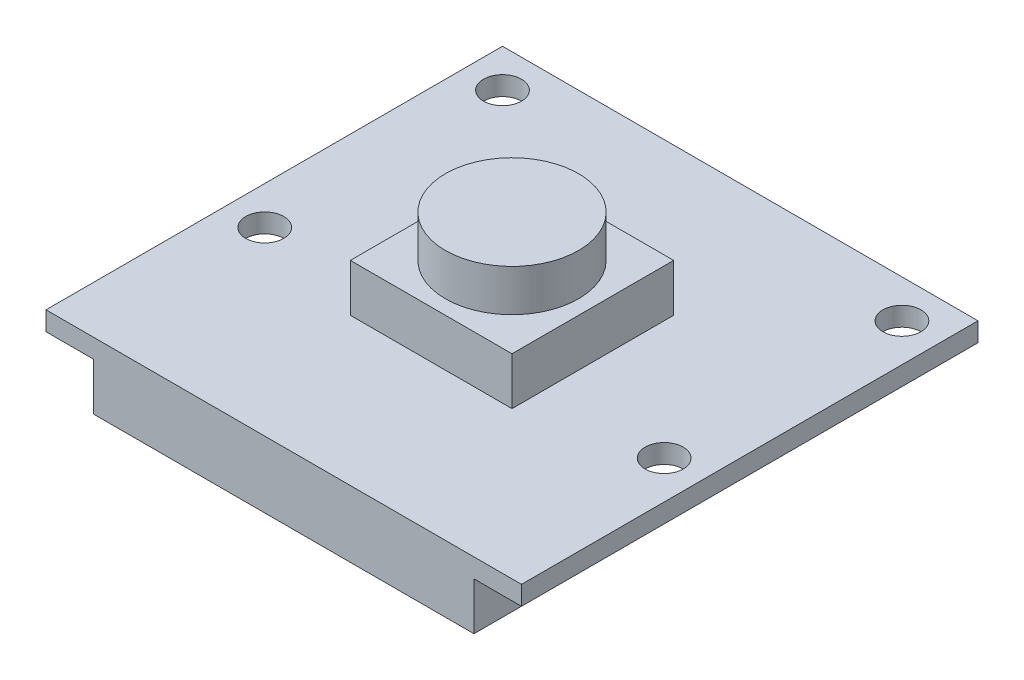
ISO-10303-21;
HEADER;
FILE_DESCRIPTION(('STEP AP214'),'2;1');
FILE_NAME('part.step','',(''),(''),'','','');
FILE_SCHEMA(('AUTOMOTIVE_DESIGN { 1 0 10303 214 1 1 1 1 }'));
ENDSEC;
DATA;
#1=APPLICATION_CONTEXT('core data for automotive mechanical design processes');
#2=APPLICATION_PROTOCOL_DEFINITION('international standard','automotive_design',2000,#1);
#3=PRODUCT_CONTEXT('',#1,'mechanical');
#4=PRODUCT('Part','Part','',(#3));
#5=PRODUCT_RELATED_PRODUCT_CATEGORY('part','',(#4));
#6=PRODUCT_DEFINITION_FORMATION('','',#4);
#7=PRODUCT_DEFINITION_CONTEXT('part definition',#1,'design');
#8=PRODUCT_DEFINITION('design','',#6,#7);
#9=PRODUCT_DEFINITION_SHAPE('','',#8);
#10=(LENGTH_UNIT() NAMED_UNIT(*) SI_UNIT(.MILLI.,.METRE.));
#11=(NAMED_UNIT(*) PLANE_ANGLE_UNIT() SI_UNIT($,.RADIAN.));
#12=(NAMED_UNIT(*) SI_UNIT($,.STERADIAN.) SOLID_ANGLE_UNIT());
#13=UNCERTAINTY_MEASURE_WITH_UNIT(LENGTH_MEASURE(1.E-05),#10,'distance_accuracy_value','');
#14=(GEOMETRIC_REPRESENTATION_CONTEXT(3) GLOBAL_UNCERTAINTY_ASSIGNED_CONTEXT((#13)) GLOBAL_UNIT_ASSIGNED_CONTEXT((#10,
#11,#12)) REPRESENTATION_CONTEXT('',''));
#15=CARTESIAN_POINT('',(0.,0.,0.));
#16=DIRECTION('',(0.,0.,1.));
#17=DIRECTION('',(1.,0.,0.));
#18=AXIS2_PLACEMENT_3D('',#15,#16,#17);
#19=CARTESIAN_POINT('',(0.,1.,0.));
#20=DIRECTION('',(0.,-1.,0.));
#21=DIRECTION('',(0.,0.,-1.));
#22=AXIS2_PLACEMENT_3D('',#19,#20,#21);
#23=PLANE('',#22);
#24=CARTESIAN_POINT('',(23.,1.,-22.));
#25=DIRECTION('',(0.,1.,0.));
#26=DIRECTION('',(0.,0.,-1.));
#27=AXIS2_PLACEMENT_3D('',#24,#25,#26);
#28=CIRCLE('',#27,0.999999999999998);
#29=CARTESIAN_POINT('',(23.,1.,-23.));
#30=VERTEX_POINT('',#29);
#31=EDGE_CURVE('E190',#30,#30,#28,.T.);
#32=ORIENTED_EDGE('',*,*,#31,.F.);
#33=EDGE_LOOP('',(#32));
#34=FACE_BOUND('',#33,.T.);
#35=CARTESIAN_POINT('',(23.,1.,-9.5));
#36=DIRECTION('',(0.,1.,0.));
#37=DIRECTION('',(0.,0.,-1.));
#38=AXIS2_PLACEMENT_3D('',#35,#36,#37);
#39=CIRCLE('',#38,0.999999999999998);
#40=CARTESIAN_POINT('',(23.,1.,-10.5));
#41=VERTEX_POINT('',#40);
#42=EDGE_CURVE('E196',#41,#41,#39,.T.);
#43=ORIENTED_EDGE('',*,*,#42,.F.);
#44=EDGE_LOOP('',(#43));
#45=FACE_BOUND('',#44,.T.);
#46=CARTESIAN_POINT('',(2.,1.,-9.5));
#47=DIRECTION('',(0.,1.,0.));
#48=DIRECTION('',(0.,0.,1.));
#49=AXIS2_PLACEMENT_3D('',#46,#47,#48);
#50=CIRCLE('',#49,1.);
#51=CARTESIAN_POINT('',(2.,1.,-8.5));
#52=VERTEX_POINT('',#51);
#53=EDGE_CURVE('E202',#52,#52,#50,.T.);
#54=ORIENTED_EDGE('',*,*,#53,.F.);
#55=EDGE_LOOP('',(#54));
#56=FACE_BOUND('',#55,.T.);
#57=CARTESIAN_POINT('',(2.,1.,-22.));
#58=DIRECTION('',(0.,1.,0.));
#59=DIRECTION('',(0.,0.,1.));
#60=AXIS2_PLACEMENT_3D('',#57,#58,#59);
#61=CIRCLE('',#60,1.);
#62=CARTESIAN_POINT('',(2.,1.,-21.));
#63=VERTEX_POINT('',#62);
#64=EDGE_CURVE('E208',#63,#63,#61,.T.);
#65=ORIENTED_EDGE('',*,*,#64,.F.);
#66=EDGE_LOOP('',(#65));
#67=FACE_BOUND('',#66,.T.);
#68=DIRECTION('',(0.,0.,1.));
#69=VECTOR('',#68,1.);
#70=CARTESIAN_POINT('',(0.,1.,0.));
#71=LINE('',#70,#69);
#72=CARTESIAN_POINT('',(0.,1.,-24.));
#73=VERTEX_POINT('',#72);
#74=CARTESIAN_POINT('',(0.,1.,0.));
#75=VERTEX_POINT('',#74);
#76=EDGE_CURVE('E214',#73,#75,#71,.T.);
#77=ORIENTED_EDGE('',*,*,#76,.T.);
#78=DIRECTION('',(1.,0.,0.));
#79=VECTOR('',#78,1.);
#80=CARTESIAN_POINT('',(0.,1.,0.));
#81=LINE('',#80,#79);
#82=CARTESIAN_POINT('',(25.,1.,0.));
#83=VERTEX_POINT('',#82);
#84=EDGE_CURVE('E217',#75,#83,#81,.T.);
#85=ORIENTED_EDGE('',*,*,#84,.T.);
#86=DIRECTION('',(0.,0.,-1.));
#87=VECTOR('',#86,1.);
#88=CARTESIAN_POINT('',(25.,1.,0.));
#89=LINE('',#88,#87);
#90=CARTESIAN_POINT('',(25.,1.,-24.));
#91=VERTEX_POINT('',#90);
#92=EDGE_CURVE('E220',#83,#91,#89,.T.);
#93=ORIENTED_EDGE('',*,*,#92,.T.);
#94=DIRECTION('',(-1.,0.,0.));
#95=VECTOR('',#94,1.);
#96=CARTESIAN_POINT('',(0.,1.,-24.));
#97=LINE('',#96,#95);
#98=EDGE_CURVE('E222',#91,#73,#97,.T.);
#99=ORIENTED_EDGE('',*,*,#98,.T.);
#100=EDGE_LOOP('',(#77,#85,#93,#99));
#101=FACE_BOUND('',#100,.T.);
#102=DIRECTION('',(0.,0.,1.));
#103=VECTOR('',#102,1.);
#104=CARTESIAN_POINT('',(8.25,1.,-16.25));
#105=LINE('',#104,#103);
#106=CARTESIAN_POINT('',(8.25,1.,-16.25));
#107=VERTEX_POINT('',#106);
#108=CARTESIAN_POINT('',(8.25,1.,-7.75));
#109=VERTEX_POINT('',#108);
#110=EDGE_CURVE('E151',#107,#109,#105,.T.);
#111=ORIENTED_EDGE('',*,*,#110,.F.);
#112=DIRECTION('',(-1.,0.,0.));
#113=VECTOR('',#112,1.);
#114=CARTESIAN_POINT('',(8.25,1.,-16.25));
#115=LINE('',#114,#113);
#116=CARTESIAN_POINT('',(16.75,1.,-16.25));
#117=VERTEX_POINT('',#116);
#118=EDGE_CURVE('E161',#117,#107,#115,.T.);
#119=ORIENTED_EDGE('',*,*,#118,.F.);
#120=DIRECTION('',(0.,0.,-1.));
#121=VECTOR('',#120,1.);
#122=CARTESIAN_POINT('',(16.75,1.,-16.25));
#123=LINE('',#122,#121);
#124=CARTESIAN_POINT('',(16.75,1.,-7.75));
#125=VERTEX_POINT('',#124);
#126=EDGE_CURVE('E173',#125,#117,#123,.T.);
#127=ORIENTED_EDGE('',*,*,#126,.F.);
#128=DIRECTION('',(1.,0.,0.));
#129=VECTOR('',#128,1.);
#130=CARTESIAN_POINT('',(8.25,1.,-7.75));
#131=LINE('',#130,#129);
#132=EDGE_CURVE('E170',#109,#125,#131,.T.);
#133=ORIENTED_EDGE('',*,*,#132,.F.);
#134=EDGE_LOOP('',(#111,#119,#127,#133));
#135=FACE_BOUND('',#134,.T.);
#136=ADVANCED_FACE('F36',(#34,#45,#56,#67,#101,#135),#23,.F.);
#137=CARTESIAN_POINT('',(0.,0.,0.));
#138=DIRECTION('',(0.,-1.,0.));
#139=DIRECTION('',(0.,0.,-1.));
#140=AXIS2_PLACEMENT_3D('',#137,#138,#139);
#141=PLANE('',#140);
#142=DIRECTION('',(0.,0.,-1.));
#143=VECTOR('',#142,1.);
#144=CARTESIAN_POINT('',(2.5,0.,0.));
#145=LINE('',#144,#143);
#146=CARTESIAN_POINT('',(2.5,0.,0.));
#147=VERTEX_POINT('',#146);
#148=CARTESIAN_POINT('',(2.5,0.,-6.00000000000001));
#149=VERTEX_POINT('',#148);
#150=EDGE_CURVE('E147',#147,#149,#145,.T.);
#151=ORIENTED_EDGE('',*,*,#150,.F.);
#152=DIRECTION('',(1.,0.,0.));
#153=VECTOR('',#152,1.);
#154=CARTESIAN_POINT('',(0.,0.,0.));
#155=LINE('',#154,#153);
#156=CARTESIAN_POINT('',(0.,0.,0.));
#157=VERTEX_POINT('',#156);
#158=EDGE_CURVE('E227',#157,#147,#155,.T.);
#159=ORIENTED_EDGE('',*,*,#158,.F.);
#160=DIRECTION('',(0.,0.,1.));
#161=VECTOR('',#160,1.);
#162=CARTESIAN_POINT('',(0.,0.,0.));
#163=LINE('',#162,#161);
#164=CARTESIAN_POINT('',(0.,0.,-24.));
#165=VERTEX_POINT('',#164);
#166=EDGE_CURVE('E211',#165,#157,#163,.T.);
#167=ORIENTED_EDGE('',*,*,#166,.F.);
#168=DIRECTION('',(-1.,0.,0.));
#169=VECTOR('',#168,1.);
#170=CARTESIAN_POINT('',(0.,0.,-24.));
#171=LINE('',#170,#169);
#172=CARTESIAN_POINT('',(25.,0.,-24.));
#173=VERTEX_POINT('',#172);
#174=EDGE_CURVE('E218',#173,#165,#171,.T.);
#175=ORIENTED_EDGE('',*,*,#174,.F.);
#176=DIRECTION('',(0.,0.,-1.));
#177=VECTOR('',#176,1.);
#178=CARTESIAN_POINT('',(25.,0.,0.));
#179=LINE('',#178,#177);
#180=CARTESIAN_POINT('',(25.,0.,0.));
#181=VERTEX_POINT('',#180);
#182=EDGE_CURVE('E230',#181,#173,#179,.T.);
#183=ORIENTED_EDGE('',*,*,#182,.F.);
#184=CARTESIAN_POINT('',(22.5,0.,0.));
#185=VERTEX_POINT('',#184);
#186=EDGE_CURVE('E58',#185,#181,#155,.T.);
#187=ORIENTED_EDGE('',*,*,#186,.F.);
#188=DIRECTION('',(0.,0.,1.));
#189=VECTOR('',#188,1.);
#190=CARTESIAN_POINT('',(22.5,0.,0.));
#191=LINE('',#190,#189);
#192=CARTESIAN_POINT('',(22.5,0.,-6.));
#193=VERTEX_POINT('',#192);
#194=EDGE_CURVE('E144',#193,#185,#191,.T.);
#195=ORIENTED_EDGE('',*,*,#194,.F.);
#196=DIRECTION('',(1.,0.,0.));
#197=VECTOR('',#196,1.);
#198=CARTESIAN_POINT('',(2.5,0.,-6.00000000000001));
#199=LINE('',#198,#197);
#200=EDGE_CURVE('E52',#149,#193,#199,.T.);
#201=ORIENTED_EDGE('',*,*,#200,.F.);
#202=EDGE_LOOP('',(#151,#159,#167,#175,#183,#187,#195,#201));
#203=FACE_BOUND('',#202,.T.);
#204=CARTESIAN_POINT('',(23.,0.,-9.5));
#205=DIRECTION('',(0.,1.,0.));
#206=DIRECTION('',(0.,0.,-1.));
#207=AXIS2_PLACEMENT_3D('',#204,#205,#206);
#208=CIRCLE('',#207,0.999999999999998);
#209=CARTESIAN_POINT('',(23.,0.,-10.5));
#210=VERTEX_POINT('',#209);
#211=EDGE_CURVE('E193',#210,#210,#208,.T.);
#212=ORIENTED_EDGE('',*,*,#211,.T.);
#213=EDGE_LOOP('',(#212));
#214=FACE_BOUND('',#213,.T.);
#215=CARTESIAN_POINT('',(2.,0.,-22.));
#216=DIRECTION('',(0.,1.,0.));
#217=DIRECTION('',(0.,0.,1.));
#218=AXIS2_PLACEMENT_3D('',#215,#216,#217);
#219=CIRCLE('',#218,1.);
#220=CARTESIAN_POINT('',(2.,0.,-21.));
#221=VERTEX_POINT('',#220);
#222=EDGE_CURVE('E205',#221,#221,#219,.T.);
#223=ORIENTED_EDGE('',*,*,#222,.T.);
#224=EDGE_LOOP('',(#223));
#225=FACE_BOUND('',#224,.T.);
#226=CARTESIAN_POINT('',(2.,0.,-9.5));
#227=DIRECTION('',(0.,1.,0.));
#228=DIRECTION('',(0.,0.,1.));
#229=AXIS2_PLACEMENT_3D('',#226,#227,#228);
#230=CIRCLE('',#229,1.);
#231=CARTESIAN_POINT('',(2.,0.,-8.5));
#232=VERTEX_POINT('',#231);
#233=EDGE_CURVE('E199',#232,#232,#230,.T.);
#234=ORIENTED_EDGE('',*,*,#233,.T.);
#235=EDGE_LOOP('',(#234));
#236=FACE_BOUND('',#235,.T.);
#237=CARTESIAN_POINT('',(23.,0.,-22.));
#238=DIRECTION('',(0.,1.,0.));
#239=DIRECTION('',(0.,0.,-1.));
#240=AXIS2_PLACEMENT_3D('',#237,#238,#239);
#241=CIRCLE('',#240,0.999999999999998);
#242=CARTESIAN_POINT('',(23.,0.,-23.));
#243=VERTEX_POINT('',#242);
#244=EDGE_CURVE('E189',#243,#243,#241,.T.);
#245=ORIENTED_EDGE('',*,*,#244,.T.);
#246=EDGE_LOOP('',(#245));
#247=FACE_BOUND('',#246,.T.);
#248=ADVANCED_FACE('F251',(#203,#214,#225,#236,#247),#141,.T.);
#249=CARTESIAN_POINT('',(0.,1.,0.));
#250=DIRECTION('',(1.,0.,0.));
#251=DIRECTION('',(0.,0.,-1.));
#252=AXIS2_PLACEMENT_3D('',#249,#250,#251);
#253=PLANE('',#252);
#254=ORIENTED_EDGE('',*,*,#166,.T.);
#255=DIRECTION('',(0.,-1.,0.));
#256=VECTOR('',#255,1.);
#257=CARTESIAN_POINT('',(0.,1.,0.));
#258=LINE('',#257,#256);
#259=EDGE_CURVE('E40',#75,#157,#258,.T.);
#260=ORIENTED_EDGE('',*,*,#259,.F.);
#261=ORIENTED_EDGE('',*,*,#76,.F.);
#262=DIRECTION('',(0.,-1.,0.));
#263=VECTOR('',#262,1.);
#264=CARTESIAN_POINT('',(0.,1.,-24.));
#265=LINE('',#264,#263);
#266=EDGE_CURVE('E224',#73,#165,#265,.T.);
#267=ORIENTED_EDGE('',*,*,#266,.T.);
#268=EDGE_LOOP('',(#254,#260,#261,#267));
#269=FACE_BOUND('',#268,.T.);
#270=ADVANCED_FACE('F38',(#269),#253,.F.);
#271=CARTESIAN_POINT('',(0.,1.,0.));
#272=DIRECTION('',(0.,0.,-1.));
#273=DIRECTION('',(-1.,0.,0.));
#274=AXIS2_PLACEMENT_3D('',#271,#272,#273);
#275=PLANE('',#274);
#276=ORIENTED_EDGE('',*,*,#158,.T.);
#277=DIRECTION('',(0.,1.,0.));
#278=VECTOR('',#277,1.);
#279=CARTESIAN_POINT('',(2.5,-2.5,0.));
#280=LINE('',#279,#278);
#281=CARTESIAN_POINT('',(2.5,-2.5,0.));
#282=VERTEX_POINT('',#281);
#283=EDGE_CURVE('E259',#282,#147,#280,.T.);
#284=ORIENTED_EDGE('',*,*,#283,.F.);
#285=DIRECTION('',(-1.,0.,0.));
#286=VECTOR('',#285,1.);
#287=CARTESIAN_POINT('',(2.5,-2.5,0.));
#288=LINE('',#287,#286);
#289=CARTESIAN_POINT('',(22.5,-2.5,0.));
#290=VERTEX_POINT('',#289);
#291=EDGE_CURVE('E140',#290,#282,#288,.T.);
#292=ORIENTED_EDGE('',*,*,#291,.F.);
#293=DIRECTION('',(0.,1.,0.));
#294=VECTOR('',#293,1.);
#295=CARTESIAN_POINT('',(22.5,-2.5,0.));
#296=LINE('',#295,#294);
#297=EDGE_CURVE('E153',#290,#185,#296,.T.);
#298=ORIENTED_EDGE('',*,*,#297,.T.);
#299=ORIENTED_EDGE('',*,*,#186,.T.);
#300=DIRECTION('',(0.,-1.,0.));
#301=VECTOR('',#300,1.);
#302=CARTESIAN_POINT('',(25.,1.,0.));
#303=LINE('',#302,#301);
#304=EDGE_CURVE('E237',#83,#181,#303,.T.);
#305=ORIENTED_EDGE('',*,*,#304,.F.);
#306=ORIENTED_EDGE('',*,*,#84,.F.);
#307=ORIENTED_EDGE('',*,*,#259,.T.);
#308=EDGE_LOOP('',(#276,#284,#292,#298,#299,#305,#306,#307));
#309=FACE_BOUND('',#308,.T.);
#310=ADVANCED_FACE('F245',(#309),#275,.F.);
#311=CARTESIAN_POINT('',(25.,1.,0.));
#312=DIRECTION('',(-1.,0.,0.));
#313=DIRECTION('',(0.,0.,1.));
#314=AXIS2_PLACEMENT_3D('',#311,#312,#313);
#315=PLANE('',#314);
#316=ORIENTED_EDGE('',*,*,#182,.T.);
#317=DIRECTION('',(0.,-1.,0.));
#318=VECTOR('',#317,1.);
#319=CARTESIAN_POINT('',(25.,1.,-24.));
#320=LINE('',#319,#318);
#321=EDGE_CURVE('E235',#91,#173,#320,.T.);
#322=ORIENTED_EDGE('',*,*,#321,.F.);
#323=ORIENTED_EDGE('',*,*,#92,.F.);
#324=ORIENTED_EDGE('',*,*,#304,.T.);
#325=EDGE_LOOP('',(#316,#322,#323,#324));
#326=FACE_BOUND('',#325,.T.);
#327=ADVANCED_FACE('F288',(#326),#315,.F.);
#328=CARTESIAN_POINT('',(0.,1.,-24.));
#329=DIRECTION('',(0.,0.,1.));
#330=DIRECTION('',(1.,0.,0.));
#331=AXIS2_PLACEMENT_3D('',#328,#329,#330);
#332=PLANE('',#331);
#333=ORIENTED_EDGE('',*,*,#174,.T.);
#334=ORIENTED_EDGE('',*,*,#266,.F.);
#335=ORIENTED_EDGE('',*,*,#98,.F.);
#336=ORIENTED_EDGE('',*,*,#321,.T.);
#337=EDGE_LOOP('',(#333,#334,#335,#336));
#338=FACE_BOUND('',#337,.T.);
#339=ADVANCED_FACE('F285',(#338),#332,.F.);
#340=CARTESIAN_POINT('',(2.,1.,-22.));
#341=DIRECTION('',(0.,-1.,0.));
#342=DIRECTION('',(0.,0.,-1.));
#343=AXIS2_PLACEMENT_3D('',#340,#341,#342);
#344=CYLINDRICAL_SURFACE('',#343,1.);
#345=ORIENTED_EDGE('',*,*,#64,.T.);
#346=EDGE_LOOP('',(#345));
#347=FACE_BOUND('',#346,.T.);
#348=ORIENTED_EDGE('',*,*,#222,.F.);
#349=EDGE_LOOP('',(#348));
#350=FACE_BOUND('',#349,.T.);
#351=ADVANCED_FACE('F282',(#347,#350),#344,.F.);
#352=CARTESIAN_POINT('',(2.,1.,-9.5));
#353=DIRECTION('',(0.,-1.,0.));
#354=DIRECTION('',(0.,0.,-1.));
#355=AXIS2_PLACEMENT_3D('',#352,#353,#354);
#356=CYLINDRICAL_SURFACE('',#355,1.);
#357=ORIENTED_EDGE('',*,*,#53,.T.);
#358=EDGE_LOOP('',(#357));
#359=FACE_BOUND('',#358,.T.);
#360=ORIENTED_EDGE('',*,*,#233,.F.);
#361=EDGE_LOOP('',(#360));
#362=FACE_BOUND('',#361,.T.);
#363=ADVANCED_FACE('F404',(#359,#362),#356,.F.);
#364=CARTESIAN_POINT('',(23.,1.,-9.5));
#365=DIRECTION('',(0.,-1.,0.));
#366=DIRECTION('',(0.,0.,-1.));
#367=AXIS2_PLACEMENT_3D('',#364,#365,#366);
#368=CYLINDRICAL_SURFACE('',#367,0.999999999999998);
#369=ORIENTED_EDGE('',*,*,#42,.T.);
#370=EDGE_LOOP('',(#369));
#371=FACE_BOUND('',#370,.T.);
#372=ORIENTED_EDGE('',*,*,#211,.F.);
#373=EDGE_LOOP('',(#372));
#374=FACE_BOUND('',#373,.T.);
#375=ADVANCED_FACE('F396',(#371,#374),#368,.F.);
#376=CARTESIAN_POINT('',(23.,1.,-22.));
#377=DIRECTION('',(0.,-1.,0.));
#378=DIRECTION('',(0.,0.,-1.));
#379=AXIS2_PLACEMENT_3D('',#376,#377,#378);
#380=CYLINDRICAL_SURFACE('',#379,0.999999999999998);
#381=ORIENTED_EDGE('',*,*,#31,.T.);
#382=EDGE_LOOP('',(#381));
#383=FACE_BOUND('',#382,.T.);
#384=ORIENTED_EDGE('',*,*,#244,.F.);
#385=EDGE_LOOP('',(#384));
#386=FACE_BOUND('',#385,.T.);
#387=ADVANCED_FACE('F388',(#383,#386),#380,.F.);
#388=CARTESIAN_POINT('',(8.25,3.5,-16.25));
#389=DIRECTION('',(1.,0.,0.));
#390=DIRECTION('',(0.,0.,-1.));
#391=AXIS2_PLACEMENT_3D('',#388,#389,#390);
#392=PLANE('',#391);
#393=ORIENTED_EDGE('',*,*,#110,.T.);
#394=DIRECTION('',(0.,-1.,0.));
#395=VECTOR('',#394,1.);
#396=CARTESIAN_POINT('',(8.25,3.5,-7.75));
#397=LINE('',#396,#395);
#398=CARTESIAN_POINT('',(8.25,3.5,-7.75));
#399=VERTEX_POINT('',#398);
#400=EDGE_CURVE('E186',#399,#109,#397,.T.);
#401=ORIENTED_EDGE('',*,*,#400,.F.);
#402=DIRECTION('',(0.,0.,1.));
#403=VECTOR('',#402,1.);
#404=CARTESIAN_POINT('',(8.25,3.5,-16.25));
#405=LINE('',#404,#403);
#406=CARTESIAN_POINT('',(8.25,3.5,-16.25));
#407=VERTEX_POINT('',#406);
#408=EDGE_CURVE('E157',#407,#399,#405,.T.);
#409=ORIENTED_EDGE('',*,*,#408,.F.);
#410=DIRECTION('',(0.,-1.,0.));
#411=VECTOR('',#410,1.);
#412=CARTESIAN_POINT('',(8.25,3.5,-16.25));
#413=LINE('',#412,#411);
#414=EDGE_CURVE('E167',#407,#107,#413,.T.);
#415=ORIENTED_EDGE('',*,*,#414,.T.);
#416=EDGE_LOOP('',(#393,#401,#409,#415));
#417=FACE_BOUND('',#416,.T.);
#418=ADVANCED_FACE('F380',(#417),#392,.F.);
#419=CARTESIAN_POINT('',(8.25,3.5,-7.75));
#420=DIRECTION('',(0.,0.,-1.));
#421=DIRECTION('',(-1.,0.,0.));
#422=AXIS2_PLACEMENT_3D('',#419,#420,#421);
#423=PLANE('',#422);
#424=ORIENTED_EDGE('',*,*,#132,.T.);
#425=DIRECTION('',(0.,-1.,0.));
#426=VECTOR('',#425,1.);
#427=CARTESIAN_POINT('',(16.75,3.5,-7.75));
#428=LINE('',#427,#426);
#429=CARTESIAN_POINT('',(16.75,3.5,-7.75));
#430=VERTEX_POINT('',#429);
#431=EDGE_CURVE('E183',#430,#125,#428,.T.);
#432=ORIENTED_EDGE('',*,*,#431,.F.);
#433=DIRECTION('',(1.,0.,0.));
#434=VECTOR('',#433,1.);
#435=CARTESIAN_POINT('',(8.25,3.5,-7.75));
#436=LINE('',#435,#434);
#437=EDGE_CURVE('E160',#399,#430,#436,.T.);
#438=ORIENTED_EDGE('',*,*,#437,.F.);
#439=ORIENTED_EDGE('',*,*,#400,.T.);
#440=EDGE_LOOP('',(#424,#432,#438,#439));
#441=FACE_BOUND('',#440,.T.);
#442=ADVANCED_FACE('F372',(#441),#423,.F.);
#443=CARTESIAN_POINT('',(16.75,3.5,-16.25));
#444=DIRECTION('',(-1.,0.,0.));
#445=DIRECTION('',(0.,0.,1.));
#446=AXIS2_PLACEMENT_3D('',#443,#444,#445);
#447=PLANE('',#446);
#448=ORIENTED_EDGE('',*,*,#126,.T.);
#449=DIRECTION('',(0.,-1.,0.));
#450=VECTOR('',#449,1.);
#451=CARTESIAN_POINT('',(16.75,3.5,-16.25));
#452=LINE('',#451,#450);
#453=CARTESIAN_POINT('',(16.75,3.5,-16.25));
#454=VERTEX_POINT('',#453);
#455=EDGE_CURVE('E180',#454,#117,#452,.T.);
#456=ORIENTED_EDGE('',*,*,#455,.F.);
#457=DIRECTION('',(0.,0.,-1.));
#458=VECTOR('',#457,1.);
#459=CARTESIAN_POINT('',(16.75,3.5,-16.25));
#460=LINE('',#459,#458);
#461=EDGE_CURVE('E163',#430,#454,#460,.T.);
#462=ORIENTED_EDGE('',*,*,#461,.F.);
#463=ORIENTED_EDGE('',*,*,#431,.T.);
#464=EDGE_LOOP('',(#448,#456,#462,#463));
#465=FACE_BOUND('',#464,.T.);
#466=ADVANCED_FACE('F364',(#465),#447,.F.);
#467=CARTESIAN_POINT('',(8.25,3.5,-16.25));
#468=DIRECTION('',(0.,0.,1.));
#469=DIRECTION('',(1.,0.,0.));
#470=AXIS2_PLACEMENT_3D('',#467,#468,#469);
#471=PLANE('',#470);
#472=ORIENTED_EDGE('',*,*,#118,.T.);
#473=ORIENTED_EDGE('',*,*,#414,.F.);
#474=DIRECTION('',(-1.,0.,0.));
#475=VECTOR('',#474,1.);
#476=CARTESIAN_POINT('',(8.25,3.5,-16.25));
#477=LINE('',#476,#475);
#478=EDGE_CURVE('E165',#454,#407,#477,.T.);
#479=ORIENTED_EDGE('',*,*,#478,.F.);
#480=ORIENTED_EDGE('',*,*,#455,.T.);
#481=EDGE_LOOP('',(#472,#473,#479,#480));
#482=FACE_BOUND('',#481,.T.);
#483=ADVANCED_FACE('F356',(#482),#471,.F.);
#484=CARTESIAN_POINT('',(0.,3.5,0.));
#485=DIRECTION('',(0.,1.,0.));
#486=DIRECTION('',(0.,0.,1.));
#487=AXIS2_PLACEMENT_3D('',#484,#485,#486);
#488=PLANE('',#487);
#489=CARTESIAN_POINT('',(12.5,3.5,-12.));
#490=DIRECTION('',(0.,1.,0.));
#491=DIRECTION('',(0.,0.,1.));
#492=AXIS2_PLACEMENT_3D('',#489,#490,#491);
#493=CIRCLE('',#492,3.5);
#494=CARTESIAN_POINT('',(12.5,3.5,-8.5));
#495=VERTEX_POINT('',#494);
#496=EDGE_CURVE('E11',#495,#495,#493,.T.);
#497=ORIENTED_EDGE('',*,*,#496,.F.);
#498=EDGE_LOOP('',(#497));
#499=FACE_BOUND('',#498,.T.);
#500=ORIENTED_EDGE('',*,*,#408,.T.);
#501=ORIENTED_EDGE('',*,*,#437,.T.);
#502=ORIENTED_EDGE('',*,*,#461,.T.);
#503=ORIENTED_EDGE('',*,*,#478,.T.);
#504=EDGE_LOOP('',(#500,#501,#502,#503));
#505=FACE_BOUND('',#504,.T.);
#506=ADVANCED_FACE('F348',(#499,#505),#488,.T.);
#507=CARTESIAN_POINT('',(12.5,5.7,-12.));
#508=DIRECTION('',(0.,-1.,0.));
#509=DIRECTION('',(0.,0.,-1.));
#510=AXIS2_PLACEMENT_3D('',#507,#508,#509);
#511=CYLINDRICAL_SURFACE('',#510,3.5);
#512=CARTESIAN_POINT('',(12.5,5.7,-12.));
#513=DIRECTION('',(0.,1.,0.));
#514=DIRECTION('',(0.,0.,1.));
#515=AXIS2_PLACEMENT_3D('',#512,#513,#514);
#516=CIRCLE('',#515,3.5);
#517=CARTESIAN_POINT('',(12.5,5.7,-8.5));
#518=VERTEX_POINT('',#517);
#519=EDGE_CURVE('E148',#518,#518,#516,.T.);
#520=ORIENTED_EDGE('',*,*,#519,.F.);
#521=EDGE_LOOP('',(#520));
#522=FACE_BOUND('',#521,.T.);
#523=ORIENTED_EDGE('',*,*,#496,.T.);
#524=EDGE_LOOP('',(#523));
#525=FACE_BOUND('',#524,.T.);
#526=ADVANCED_FACE('F343',(#522,#525),#511,.T.);
#527=CARTESIAN_POINT('',(12.5,5.7,-12.));
#528=DIRECTION('',(0.,1.,0.));
#529=DIRECTION('',(0.,0.,1.));
#530=AXIS2_PLACEMENT_3D('',#527,#528,#529);
#531=PLANE('',#530);
#532=ORIENTED_EDGE('',*,*,#519,.T.);
#533=EDGE_LOOP('',(#532));
#534=FACE_BOUND('',#533,.T.);
#535=ADVANCED_FACE('F307',(#534),#531,.T.);
#536=CARTESIAN_POINT('',(2.5,-2.5,0.));
#537=DIRECTION('',(1.,0.,0.));
#538=DIRECTION('',(0.,0.,-1.));
#539=AXIS2_PLACEMENT_3D('',#536,#537,#538);
#540=PLANE('',#539);
#541=ORIENTED_EDGE('',*,*,#150,.T.);
#542=DIRECTION('',(0.,1.,0.));
#543=VECTOR('',#542,1.);
#544=CARTESIAN_POINT('',(2.5,-2.5,-6.00000000000001));
#545=LINE('',#544,#543);
#546=CARTESIAN_POINT('',(2.5,-2.5,-6.00000000000001));
#547=VERTEX_POINT('',#546);
#548=EDGE_CURVE('E128',#547,#149,#545,.T.);
#549=ORIENTED_EDGE('',*,*,#548,.F.);
#550=DIRECTION('',(0.,0.,-1.));
#551=VECTOR('',#550,1.);
#552=CARTESIAN_POINT('',(2.5,-2.5,0.));
#553=LINE('',#552,#551);
#554=EDGE_CURVE('E135',#282,#547,#553,.T.);
#555=ORIENTED_EDGE('',*,*,#554,.F.);
#556=ORIENTED_EDGE('',*,*,#283,.T.);
#557=EDGE_LOOP('',(#541,#549,#555,#556));
#558=FACE_BOUND('',#557,.T.);
#559=ADVANCED_FACE('F146',(#558),#540,.F.);
#560=CARTESIAN_POINT('',(2.5,-2.5,-6.00000000000001));
#561=DIRECTION('',(0.,0.,1.));
#562=DIRECTION('',(1.,0.,0.));
#563=AXIS2_PLACEMENT_3D('',#560,#561,#562);
#564=PLANE('',#563);
#565=ORIENTED_EDGE('',*,*,#200,.T.);
#566=DIRECTION('',(0.,1.,0.));
#567=VECTOR('',#566,1.);
#568=CARTESIAN_POINT('',(22.5,-2.5,-6.));
#569=LINE('',#568,#567);
#570=CARTESIAN_POINT('',(22.5,-2.5,-6.));
#571=VERTEX_POINT('',#570);
#572=EDGE_CURVE('E131',#571,#193,#569,.T.);
#573=ORIENTED_EDGE('',*,*,#572,.F.);
#574=DIRECTION('',(1.,0.,0.));
#575=VECTOR('',#574,1.);
#576=CARTESIAN_POINT('',(2.5,-2.5,-6.00000000000001));
#577=LINE('',#576,#575);
#578=EDGE_CURVE('E124',#547,#571,#577,.T.);
#579=ORIENTED_EDGE('',*,*,#578,.F.);
#580=ORIENTED_EDGE('',*,*,#548,.T.);
#581=EDGE_LOOP('',(#565,#573,#579,#580));
#582=FACE_BOUND('',#581,.T.);
#583=ADVANCED_FACE('F126',(#582),#564,.F.);
#584=CARTESIAN_POINT('',(22.5,-2.5,0.));
#585=DIRECTION('',(-1.,0.,0.));
#586=DIRECTION('',(0.,0.,1.));
#587=AXIS2_PLACEMENT_3D('',#584,#585,#586);
#588=PLANE('',#587);
#589=ORIENTED_EDGE('',*,*,#194,.T.);
#590=ORIENTED_EDGE('',*,*,#297,.F.);
#591=DIRECTION('',(0.,0.,1.));
#592=VECTOR('',#591,1.);
#593=CARTESIAN_POINT('',(22.5,-2.5,0.));
#594=LINE('',#593,#592);
#595=EDGE_CURVE('E134',#571,#290,#594,.T.);
#596=ORIENTED_EDGE('',*,*,#595,.F.);
#597=ORIENTED_EDGE('',*,*,#572,.T.);
#598=EDGE_LOOP('',(#589,#590,#596,#597));
#599=FACE_BOUND('',#598,.T.);
#600=ADVANCED_FACE('F263',(#599),#588,.F.);
#601=CARTESIAN_POINT('',(0.,-2.5,0.));
#602=DIRECTION('',(0.,-1.,0.));
#603=DIRECTION('',(0.,0.,-1.));
#604=AXIS2_PLACEMENT_3D('',#601,#602,#603);
#605=PLANE('',#604);
#606=ORIENTED_EDGE('',*,*,#554,.T.);
#607=ORIENTED_EDGE('',*,*,#578,.T.);
#608=ORIENTED_EDGE('',*,*,#595,.T.);
#609=ORIENTED_EDGE('',*,*,#291,.T.);
#610=EDGE_LOOP('',(#606,#607,#608,#609));
#611=FACE_BOUND('',#610,.T.);
#612=ADVANCED_FACE('F138',(#611),#605,.T.);
#613=CLOSED_SHELL('',(#136,#248,#270,#310,#327,#339,#351,#363,#375,#387,#418,#442,#466,#483,
#506,#526,#535,#559,#583,#600,#612));
#614=MANIFOLD_SOLID_BREP('B2',#613);
#615=ADVANCED_BREP_SHAPE_REPRESENTATION('',(#18,#614),#14);
#616=SHAPE_DEFINITION_REPRESENTATION(#9,#615);
ENDSEC;
END-ISO-10303-21;
